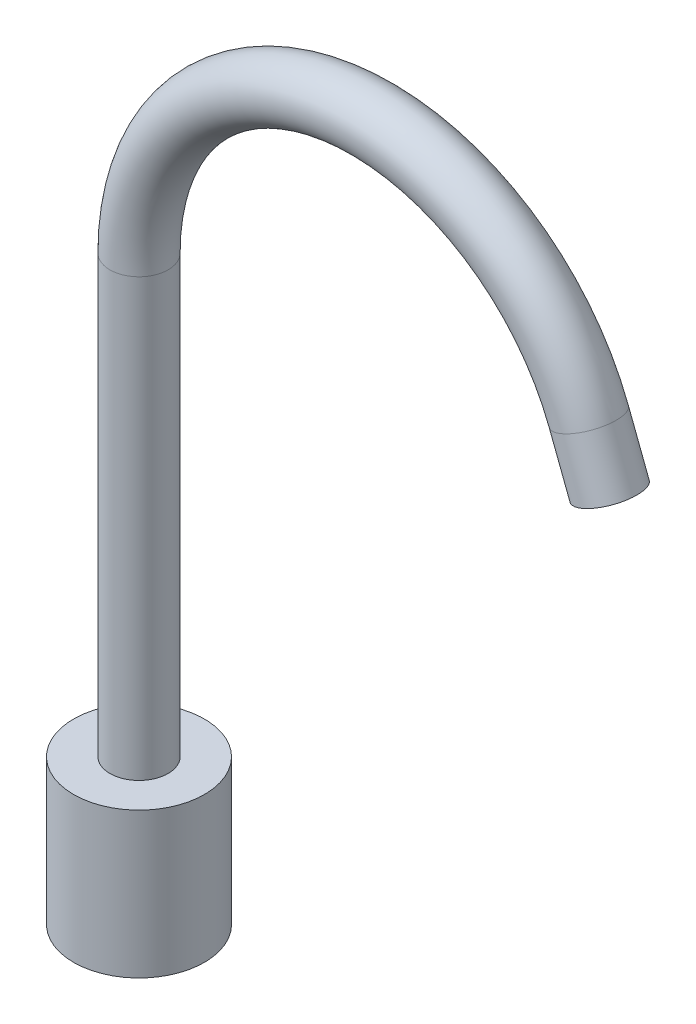
ISO-10303-21;
HEADER;
FILE_DESCRIPTION(('STEP AP214'),'2;1');
FILE_NAME('part.step','',(''),(''),'','','');
FILE_SCHEMA(('AUTOMOTIVE_DESIGN { 1 0 10303 214 1 1 1 1 }'));
ENDSEC;
DATA;
#1=APPLICATION_CONTEXT('core data for automotive mechanical design processes');
#2=APPLICATION_PROTOCOL_DEFINITION('international standard','automotive_design',2000,#1);
#3=PRODUCT_CONTEXT('',#1,'mechanical');
#4=PRODUCT('Part','Part','',(#3));
#5=PRODUCT_RELATED_PRODUCT_CATEGORY('part','',(#4));
#6=PRODUCT_DEFINITION_FORMATION('','',#4);
#7=PRODUCT_DEFINITION_CONTEXT('part definition',#1,'design');
#8=PRODUCT_DEFINITION('design','',#6,#7);
#9=PRODUCT_DEFINITION_SHAPE('','',#8);
#10=(LENGTH_UNIT() NAMED_UNIT(*) SI_UNIT(.MILLI.,.METRE.));
#11=(NAMED_UNIT(*) PLANE_ANGLE_UNIT() SI_UNIT($,.RADIAN.));
#12=(NAMED_UNIT(*) SI_UNIT($,.STERADIAN.) SOLID_ANGLE_UNIT());
#13=UNCERTAINTY_MEASURE_WITH_UNIT(LENGTH_MEASURE(1.E-05),#10,'distance_accuracy_value','');
#14=(GEOMETRIC_REPRESENTATION_CONTEXT(3) GLOBAL_UNCERTAINTY_ASSIGNED_CONTEXT((#13)) GLOBAL_UNIT_ASSIGNED_CONTEXT((#10,
#11,#12)) REPRESENTATION_CONTEXT('',''));
#15=CARTESIAN_POINT('',(0.,0.,0.));
#16=DIRECTION('',(0.,0.,1.));
#17=DIRECTION('',(1.,0.,0.));
#18=AXIS2_PLACEMENT_3D('',#15,#16,#17);
#19=CARTESIAN_POINT('',(161.859646068036,209.949791234789,0.));
#20=DIRECTION('',(0.357820032374096,-0.933790567756925,0.));
#21=DIRECTION('',(0.,0.,1.));
#22=AXIS2_PLACEMENT_3D('',#19,#20,#21);
#23=PLANE('',#22);
#24=CARTESIAN_POINT('',(161.859646068036,209.949791234789,0.));
#25=DIRECTION('',(0.357820032374096,-0.933790567756925,0.));
#26=DIRECTION('',(0.,0.,1.));
#27=AXIS2_PLACEMENT_3D('',#24,#25,#26);
#28=CIRCLE('',#27,10.);
#29=CARTESIAN_POINT('',(161.859646068036,209.949791234789,10.));
#30=VERTEX_POINT('',#29);
#31=EDGE_CURVE('E42',#30,#30,#28,.T.);
#32=ORIENTED_EDGE('',*,*,#31,.T.);
#33=EDGE_LOOP('',(#32));
#34=FACE_BOUND('',#33,.T.);
#35=ADVANCED_FACE('F35',(#34),#23,.T.);
#36=CARTESIAN_POINT('',(0.,0.,0.));
#37=DIRECTION('',(0.,1.,0.));
#38=DIRECTION('',(0.,0.,1.));
#39=AXIS2_PLACEMENT_3D('',#36,#37,#38);
#40=CYLINDRICAL_SURFACE('',#39,10.);
#41=CARTESIAN_POINT('',(0.,50.,0.));
#42=DIRECTION('',(0.,1.,0.));
#43=DIRECTION('',(0.,0.,1.));
#44=AXIS2_PLACEMENT_3D('',#41,#42,#43);
#45=CIRCLE('',#44,10.);
#46=CARTESIAN_POINT('',(0.,50.,10.));
#47=VERTEX_POINT('',#46);
#48=EDGE_CURVE('E11',#47,#47,#45,.F.);
#49=ORIENTED_EDGE('',*,*,#48,.F.);
#50=EDGE_LOOP('',(#49));
#51=FACE_BOUND('',#50,.T.);
#52=CARTESIAN_POINT('',(0.,200.,0.));
#53=DIRECTION('',(0.,1.,0.));
#54=DIRECTION('',(0.,0.,1.));
#55=AXIS2_PLACEMENT_3D('',#52,#53,#54);
#56=CIRCLE('',#55,10.);
#57=CARTESIAN_POINT('',(-9.99999999999995,200.,0.));
#58=VERTEX_POINT('',#57);
#59=EDGE_CURVE('E49',#58,#58,#56,.T.);
#60=ORIENTED_EDGE('',*,*,#59,.F.);
#61=EDGE_LOOP('',(#60));
#62=FACE_BOUND('',#61,.T.);
#63=ADVANCED_FACE('F82',(#51,#62),#40,.T.);
#64=CARTESIAN_POINT('',(80.,200.,0.));
#65=DIRECTION('',(0.,0.,-1.));
#66=DIRECTION('',(-1.,0.,0.));
#67=AXIS2_PLACEMENT_3D('',#64,#65,#66);
#68=TOROIDAL_SURFACE('',#67,80.,10.);
#69=CARTESIAN_POINT('',(154.703245420554,228.625602589927,0.));
#70=DIRECTION('',(0.357820032374093,-0.933790567756926,0.));
#71=DIRECTION('',(0.,0.,1.));
#72=AXIS2_PLACEMENT_3D('',#69,#70,#71);
#73=CIRCLE('',#72,10.);
#74=CARTESIAN_POINT('',(164.041151098123,232.203802913668,0.));
#75=VERTEX_POINT('',#74);
#76=EDGE_CURVE('E47',#75,#75,#73,.T.);
#77=CARTESIAN_POINT('',(80.,200.,0.));
#78=DIRECTION('',(0.,0.,-1.));
#79=DIRECTION('',(-1.,0.,0.));
#80=AXIS2_PLACEMENT_3D('',#77,#78,#79);
#81=CIRCLE('',#80,90.);
#82=EDGE_CURVE('',#58,#75,#81,.T.);
#83=ORIENTED_EDGE('',*,*,#59,.T.);
#84=ORIENTED_EDGE('',*,*,#76,.F.);
#85=ORIENTED_EDGE('',*,*,#82,.T.);
#86=ORIENTED_EDGE('',*,*,#82,.F.);
#87=EDGE_LOOP('',(#83,#85,#84,#86));
#88=FACE_BOUND('',#87,.T.);
#89=ADVANCED_FACE('F77',(#88),#68,.T.);
#90=CARTESIAN_POINT('',(154.703245420554,228.625602589927,0.));
#91=DIRECTION('',(0.357820032374096,-0.933790567756925,0.));
#92=DIRECTION('',(0.933790567756925,0.357820032374096,0.));
#93=AXIS2_PLACEMENT_3D('',#90,#91,#92);
#94=CYLINDRICAL_SURFACE('',#93,10.);
#95=ORIENTED_EDGE('',*,*,#31,.F.);
#96=EDGE_LOOP('',(#95));
#97=FACE_BOUND('',#96,.T.);
#98=ORIENTED_EDGE('',*,*,#76,.T.);
#99=EDGE_LOOP('',(#98));
#100=FACE_BOUND('',#99,.T.);
#101=ADVANCED_FACE('F66',(#97,#100),#94,.T.);
#102=CARTESIAN_POINT('',(0.,50.,0.));
#103=DIRECTION('',(0.,-1.,0.));
#104=DIRECTION('',(0.,0.,-1.));
#105=AXIS2_PLACEMENT_3D('',#102,#103,#104);
#106=CYLINDRICAL_SURFACE('',#105,22.5);
#107=CARTESIAN_POINT('',(0.,50.,0.));
#108=DIRECTION('',(0.,1.,0.));
#109=DIRECTION('',(0.,0.,1.));
#110=AXIS2_PLACEMENT_3D('',#107,#108,#109);
#111=CIRCLE('',#110,22.5);
#112=CARTESIAN_POINT('',(0.,50.,22.5));
#113=VERTEX_POINT('',#112);
#114=EDGE_CURVE('E54',#113,#113,#111,.T.);
#115=ORIENTED_EDGE('',*,*,#114,.F.);
#116=EDGE_LOOP('',(#115));
#117=FACE_BOUND('',#116,.T.);
#118=CARTESIAN_POINT('',(0.,0.,0.));
#119=DIRECTION('',(0.,1.,0.));
#120=DIRECTION('',(0.,0.,1.));
#121=AXIS2_PLACEMENT_3D('',#118,#119,#120);
#122=CIRCLE('',#121,22.5);
#123=CARTESIAN_POINT('',(0.,0.,22.5));
#124=VERTEX_POINT('',#123);
#125=EDGE_CURVE('E55',#124,#124,#122,.T.);
#126=ORIENTED_EDGE('',*,*,#125,.T.);
#127=EDGE_LOOP('',(#126));
#128=FACE_BOUND('',#127,.T.);
#129=ADVANCED_FACE('F63',(#117,#128),#106,.T.);
#130=CARTESIAN_POINT('',(0.,50.,0.));
#131=DIRECTION('',(0.,1.,0.));
#132=DIRECTION('',(0.,0.,1.));
#133=AXIS2_PLACEMENT_3D('',#130,#131,#132);
#134=PLANE('',#133);
#135=ORIENTED_EDGE('',*,*,#48,.T.);
#136=EDGE_LOOP('',(#135));
#137=FACE_BOUND('',#136,.T.);
#138=ORIENTED_EDGE('',*,*,#114,.T.);
#139=EDGE_LOOP('',(#138));
#140=FACE_BOUND('',#139,.T.);
#141=ADVANCED_FACE('F61',(#137,#140),#134,.T.);
#142=CARTESIAN_POINT('',(0.,0.,0.));
#143=DIRECTION('',(0.,1.,0.));
#144=DIRECTION('',(0.,0.,1.));
#145=AXIS2_PLACEMENT_3D('',#142,#143,#144);
#146=PLANE('',#145);
#147=ORIENTED_EDGE('',*,*,#125,.F.);
#148=EDGE_LOOP('',(#147));
#149=FACE_BOUND('',#148,.T.);
#150=ADVANCED_FACE('F37',(#149),#146,.F.);
#151=CLOSED_SHELL('',(#35,#63,#89,#101,#129,#141,#150));
#152=MANIFOLD_SOLID_BREP('B2',#151);
#153=ADVANCED_BREP_SHAPE_REPRESENTATION('',(#18,#152),#14);
#154=SHAPE_DEFINITION_REPRESENTATION(#9,#153);
ENDSEC;
END-ISO-10303-21;
